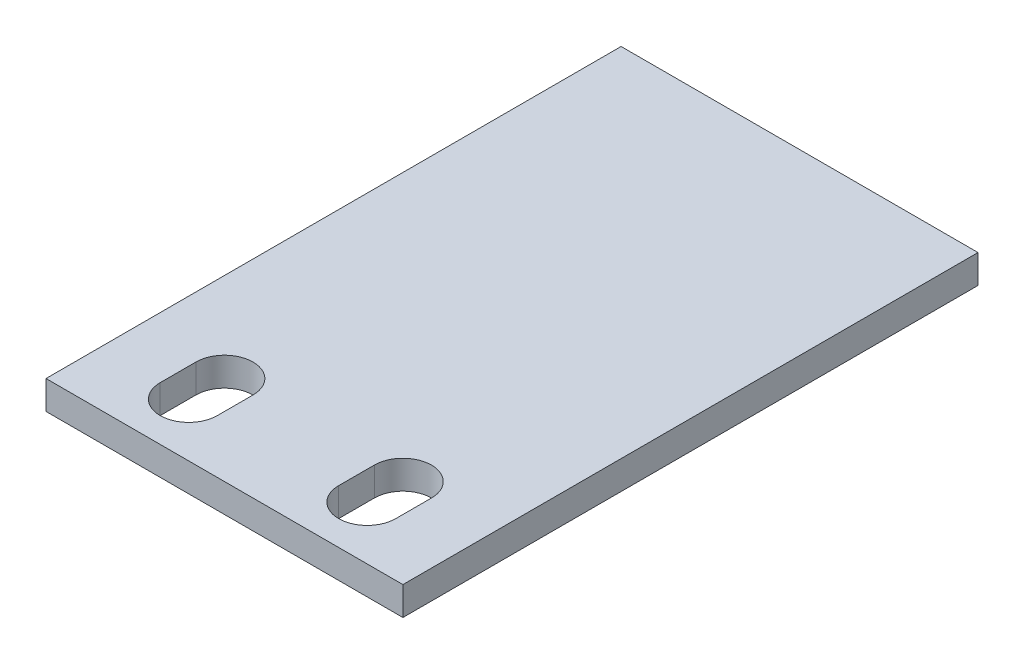
ISO-10303-21;
HEADER;
FILE_DESCRIPTION(('STEP AP214'),'2;1');
FILE_NAME('part.step','',(''),(''),'','','');
FILE_SCHEMA(('AUTOMOTIVE_DESIGN { 1 0 10303 214 1 1 1 1 }'));
ENDSEC;
DATA;
#1=APPLICATION_CONTEXT('core data for automotive mechanical design processes');
#2=APPLICATION_PROTOCOL_DEFINITION('international standard','automotive_design',2000,#1);
#3=PRODUCT_CONTEXT('',#1,'mechanical');
#4=PRODUCT('Part','Part','',(#3));
#5=PRODUCT_RELATED_PRODUCT_CATEGORY('part','',(#4));
#6=PRODUCT_DEFINITION_FORMATION('','',#4);
#7=PRODUCT_DEFINITION_CONTEXT('part definition',#1,'design');
#8=PRODUCT_DEFINITION('design','',#6,#7);
#9=PRODUCT_DEFINITION_SHAPE('','',#8);
#10=(LENGTH_UNIT() NAMED_UNIT(*) SI_UNIT(.MILLI.,.METRE.));
#11=(NAMED_UNIT(*) PLANE_ANGLE_UNIT() SI_UNIT($,.RADIAN.));
#12=(NAMED_UNIT(*) SI_UNIT($,.STERADIAN.) SOLID_ANGLE_UNIT());
#13=UNCERTAINTY_MEASURE_WITH_UNIT(LENGTH_MEASURE(1.E-05),#10,'distance_accuracy_value','');
#14=(GEOMETRIC_REPRESENTATION_CONTEXT(3) GLOBAL_UNCERTAINTY_ASSIGNED_CONTEXT((#13)) GLOBAL_UNIT_ASSIGNED_CONTEXT((#10,
#11,#12)) REPRESENTATION_CONTEXT('',''));
#15=CARTESIAN_POINT('',(0.,0.,0.));
#16=DIRECTION('',(0.,0.,1.));
#17=DIRECTION('',(1.,0.,0.));
#18=AXIS2_PLACEMENT_3D('',#15,#16,#17);
#19=CARTESIAN_POINT('',(10.,1.8,10.0274333882308));
#20=DIRECTION('',(1.,0.,0.));
#21=DIRECTION('',(0.,1.,0.));
#22=AXIS2_PLACEMENT_3D('',#19,#20,#21);
#23=PLANE('',#22);
#24=DIRECTION('',(0.,0.,1.));
#25=VECTOR('',#24,1.);
#26=CARTESIAN_POINT('',(10.,-0.8,9.22743338823082));
#27=LINE('',#26,#25);
#28=CARTESIAN_POINT('',(10.,-0.799999999999996,-10.));
#29=VERTEX_POINT('',#28);
#30=CARTESIAN_POINT('',(10.,-0.8,22.2274333882308));
#31=VERTEX_POINT('',#30);
#32=EDGE_CURVE('E227',#29,#31,#27,.T.);
#33=ORIENTED_EDGE('',*,*,#32,.F.);
#34=DIRECTION('',(0.,-1.,0.));
#35=VECTOR('',#34,1.);
#36=CARTESIAN_POINT('',(10.,0.800000000000004,-10.));
#37=LINE('',#36,#35);
#38=CARTESIAN_POINT('',(10.,0.800000000000004,-10.));
#39=VERTEX_POINT('',#38);
#40=EDGE_CURVE('E160',#39,#29,#37,.T.);
#41=ORIENTED_EDGE('',*,*,#40,.F.);
#42=DIRECTION('',(0.,0.,1.));
#43=VECTOR('',#42,1.);
#44=CARTESIAN_POINT('',(10.,0.8,9.22743338823082));
#45=LINE('',#44,#43);
#46=CARTESIAN_POINT('',(10.,0.8,22.2274333882308));
#47=VERTEX_POINT('',#46);
#48=EDGE_CURVE('E149',#39,#47,#45,.T.);
#49=ORIENTED_EDGE('',*,*,#48,.T.);
#50=DIRECTION('',(0.,1.,0.));
#51=VECTOR('',#50,1.);
#52=CARTESIAN_POINT('',(10.,-0.8,22.2274333882308));
#53=LINE('',#52,#51);
#54=EDGE_CURVE('E223',#31,#47,#53,.T.);
#55=ORIENTED_EDGE('',*,*,#54,.F.);
#56=EDGE_LOOP('',(#33,#41,#49,#55));
#57=FACE_BOUND('',#56,.T.);
#58=ADVANCED_FACE('F45',(#57),#23,.T.);
#59=CARTESIAN_POINT('',(10.,0.8,9.22743338823082));
#60=DIRECTION('',(0.,-1.,0.));
#61=DIRECTION('',(1.,0.,0.));
#62=AXIS2_PLACEMENT_3D('',#59,#60,#61);
#63=PLANE('',#62);
#64=DIRECTION('',(0.,0.,1.));
#65=VECTOR('',#64,1.);
#66=CARTESIAN_POINT('',(6.6,0.8,9.22743338823082));
#67=LINE('',#66,#65);
#68=CARTESIAN_POINT('',(6.6,0.8,17.2274333882308));
#69=VERTEX_POINT('',#68);
#70=CARTESIAN_POINT('',(6.6,0.8,19.2274333882308));
#71=VERTEX_POINT('',#70);
#72=EDGE_CURVE('E217',#69,#71,#67,.T.);
#73=ORIENTED_EDGE('',*,*,#72,.T.);
#74=CARTESIAN_POINT('',(5.,0.8,19.2274333882308));
#75=DIRECTION('',(0.,-1.,0.));
#76=DIRECTION('',(1.,0.,0.));
#77=AXIS2_PLACEMENT_3D('',#74,#75,#76);
#78=CIRCLE('',#77,1.6);
#79=CARTESIAN_POINT('',(3.4,0.8,19.2274333882308));
#80=VERTEX_POINT('',#79);
#81=EDGE_CURVE('E144',#71,#80,#78,.T.);
#82=ORIENTED_EDGE('',*,*,#81,.T.);
#83=DIRECTION('',(0.,0.,-1.));
#84=VECTOR('',#83,1.);
#85=CARTESIAN_POINT('',(3.4,0.8,9.22743338823081));
#86=LINE('',#85,#84);
#87=CARTESIAN_POINT('',(3.4,0.8,17.2274333882308));
#88=VERTEX_POINT('',#87);
#89=EDGE_CURVE('E211',#80,#88,#86,.T.);
#90=ORIENTED_EDGE('',*,*,#89,.T.);
#91=CARTESIAN_POINT('',(5.,0.8,17.2274333882308));
#92=DIRECTION('',(0.,-1.,0.));
#93=DIRECTION('',(1.,0.,0.));
#94=AXIS2_PLACEMENT_3D('',#91,#92,#93);
#95=CIRCLE('',#94,1.6);
#96=EDGE_CURVE('E214',#88,#69,#95,.T.);
#97=ORIENTED_EDGE('',*,*,#96,.T.);
#98=EDGE_LOOP('',(#73,#82,#90,#97));
#99=FACE_BOUND('',#98,.T.);
#100=DIRECTION('',(0.,0.,1.));
#101=VECTOR('',#100,1.);
#102=CARTESIAN_POINT('',(-3.4,0.8,9.22743338823081));
#103=LINE('',#102,#101);
#104=CARTESIAN_POINT('',(-3.4,0.8,17.2274333882308));
#105=VERTEX_POINT('',#104);
#106=CARTESIAN_POINT('',(-3.4,0.8,19.2274333882308));
#107=VERTEX_POINT('',#106);
#108=EDGE_CURVE('E205',#105,#107,#103,.T.);
#109=ORIENTED_EDGE('',*,*,#108,.T.);
#110=CARTESIAN_POINT('',(-5.,0.8,19.2274333882308));
#111=DIRECTION('',(0.,-1.,0.));
#112=DIRECTION('',(1.,0.,0.));
#113=AXIS2_PLACEMENT_3D('',#110,#111,#112);
#114=CIRCLE('',#113,1.6);
#115=CARTESIAN_POINT('',(-6.6,0.8,19.2274333882308));
#116=VERTEX_POINT('',#115);
#117=EDGE_CURVE('E208',#107,#116,#114,.T.);
#118=ORIENTED_EDGE('',*,*,#117,.T.);
#119=DIRECTION('',(0.,0.,-1.));
#120=VECTOR('',#119,1.);
#121=CARTESIAN_POINT('',(-6.6,0.8,9.22743338823082));
#122=LINE('',#121,#120);
#123=CARTESIAN_POINT('',(-6.6,0.8,17.2274333882308));
#124=VERTEX_POINT('',#123);
#125=EDGE_CURVE('E178',#116,#124,#122,.T.);
#126=ORIENTED_EDGE('',*,*,#125,.T.);
#127=CARTESIAN_POINT('',(-5.,0.8,17.2274333882308));
#128=DIRECTION('',(0.,-1.,0.));
#129=DIRECTION('',(1.,0.,0.));
#130=AXIS2_PLACEMENT_3D('',#127,#128,#129);
#131=CIRCLE('',#130,1.6);
#132=EDGE_CURVE('E202',#124,#105,#131,.T.);
#133=ORIENTED_EDGE('',*,*,#132,.T.);
#134=EDGE_LOOP('',(#109,#118,#126,#133));
#135=FACE_BOUND('',#134,.T.);
#136=DIRECTION('',(0.,0.,1.));
#137=VECTOR('',#136,1.);
#138=CARTESIAN_POINT('',(-10.,0.8,9.22743338823082));
#139=LINE('',#138,#137);
#140=CARTESIAN_POINT('',(-10.,0.800000000000004,-10.));
#141=VERTEX_POINT('',#140);
#142=CARTESIAN_POINT('',(-10.,0.8,22.2274333882308));
#143=VERTEX_POINT('',#142);
#144=EDGE_CURVE('E134',#141,#143,#139,.T.);
#145=ORIENTED_EDGE('',*,*,#144,.T.);
#146=DIRECTION('',(-1.,0.,0.));
#147=VECTOR('',#146,1.);
#148=CARTESIAN_POINT('',(10.,0.8,22.2274333882308));
#149=LINE('',#148,#147);
#150=EDGE_CURVE('E12',#47,#143,#149,.T.);
#151=ORIENTED_EDGE('',*,*,#150,.F.);
#152=ORIENTED_EDGE('',*,*,#48,.F.);
#153=DIRECTION('',(-1.,0.,0.));
#154=VECTOR('',#153,1.);
#155=CARTESIAN_POINT('',(10.,0.800000000000004,-10.));
#156=LINE('',#155,#154);
#157=EDGE_CURVE('E147',#39,#141,#156,.T.);
#158=ORIENTED_EDGE('',*,*,#157,.T.);
#159=EDGE_LOOP('',(#145,#151,#152,#158));
#160=FACE_BOUND('',#159,.T.);
#161=ADVANCED_FACE('F148',(#99,#135,#160),#63,.F.);
#162=CARTESIAN_POINT('',(10.,-0.8,22.2274333882308));
#163=DIRECTION('',(0.,0.,1.));
#164=DIRECTION('',(0.,-1.,0.));
#165=AXIS2_PLACEMENT_3D('',#162,#163,#164);
#166=PLANE('',#165);
#167=DIRECTION('',(0.,1.,0.));
#168=VECTOR('',#167,1.);
#169=CARTESIAN_POINT('',(-10.,-0.8,22.2274333882308));
#170=LINE('',#169,#168);
#171=CARTESIAN_POINT('',(-10.,-0.8,22.2274333882308));
#172=VERTEX_POINT('',#171);
#173=EDGE_CURVE('E141',#172,#143,#170,.T.);
#174=ORIENTED_EDGE('',*,*,#173,.F.);
#175=DIRECTION('',(-1.,0.,0.));
#176=VECTOR('',#175,1.);
#177=CARTESIAN_POINT('',(10.,-0.8,22.2274333882308));
#178=LINE('',#177,#176);
#179=EDGE_CURVE('E53',#31,#172,#178,.T.);
#180=ORIENTED_EDGE('',*,*,#179,.F.);
#181=ORIENTED_EDGE('',*,*,#54,.T.);
#182=ORIENTED_EDGE('',*,*,#150,.T.);
#183=EDGE_LOOP('',(#174,#180,#181,#182));
#184=FACE_BOUND('',#183,.T.);
#185=ADVANCED_FACE('F234',(#184),#166,.T.);
#186=CARTESIAN_POINT('',(10.,-0.8,10.));
#187=DIRECTION('',(0.,-1.,0.));
#188=DIRECTION('',(0.,0.,-1.));
#189=AXIS2_PLACEMENT_3D('',#186,#187,#188);
#190=PLANE('',#189);
#191=CARTESIAN_POINT('',(5.,-0.8,19.2274333882308));
#192=DIRECTION('',(0.,-1.,0.));
#193=DIRECTION('',(1.,0.,0.));
#194=AXIS2_PLACEMENT_3D('',#191,#192,#193);
#195=CIRCLE('',#194,1.6);
#196=CARTESIAN_POINT('',(6.6,-0.8,19.2274333882308));
#197=VERTEX_POINT('',#196);
#198=CARTESIAN_POINT('',(3.4,-0.8,19.2274333882308));
#199=VERTEX_POINT('',#198);
#200=EDGE_CURVE('E164',#197,#199,#195,.T.);
#201=ORIENTED_EDGE('',*,*,#200,.F.);
#202=DIRECTION('',(0.,0.,1.));
#203=VECTOR('',#202,1.);
#204=CARTESIAN_POINT('',(6.6,-0.8,19.2274333882308));
#205=LINE('',#204,#203);
#206=CARTESIAN_POINT('',(6.6,-0.8,17.2274333882308));
#207=VERTEX_POINT('',#206);
#208=EDGE_CURVE('E172',#207,#197,#205,.T.);
#209=ORIENTED_EDGE('',*,*,#208,.F.);
#210=CARTESIAN_POINT('',(5.,-0.8,17.2274333882308));
#211=DIRECTION('',(0.,-1.,0.));
#212=DIRECTION('',(1.,0.,0.));
#213=AXIS2_PLACEMENT_3D('',#210,#211,#212);
#214=CIRCLE('',#213,1.6);
#215=CARTESIAN_POINT('',(3.4,-0.8,17.2274333882308));
#216=VERTEX_POINT('',#215);
#217=EDGE_CURVE('E169',#216,#207,#214,.T.);
#218=ORIENTED_EDGE('',*,*,#217,.F.);
#219=DIRECTION('',(0.,0.,-1.));
#220=VECTOR('',#219,1.);
#221=CARTESIAN_POINT('',(3.4,-0.8,19.2274333882308));
#222=LINE('',#221,#220);
#223=EDGE_CURVE('E166',#199,#216,#222,.T.);
#224=ORIENTED_EDGE('',*,*,#223,.F.);
#225=EDGE_LOOP('',(#201,#209,#218,#224));
#226=FACE_BOUND('',#225,.T.);
#227=CARTESIAN_POINT('',(-5.,-0.8,19.2274333882308));
#228=DIRECTION('',(0.,-1.,0.));
#229=DIRECTION('',(1.,0.,0.));
#230=AXIS2_PLACEMENT_3D('',#227,#228,#229);
#231=CIRCLE('',#230,1.6);
#232=CARTESIAN_POINT('',(-3.4,-0.8,19.2274333882308));
#233=VERTEX_POINT('',#232);
#234=CARTESIAN_POINT('',(-6.6,-0.8,19.2274333882308));
#235=VERTEX_POINT('',#234);
#236=EDGE_CURVE('E167',#233,#235,#231,.T.);
#237=ORIENTED_EDGE('',*,*,#236,.F.);
#238=DIRECTION('',(0.,0.,1.));
#239=VECTOR('',#238,1.);
#240=CARTESIAN_POINT('',(-3.4,-0.8,19.2274333882308));
#241=LINE('',#240,#239);
#242=CARTESIAN_POINT('',(-3.4,-0.8,17.2274333882308));
#243=VERTEX_POINT('',#242);
#244=EDGE_CURVE('E187',#243,#233,#241,.T.);
#245=ORIENTED_EDGE('',*,*,#244,.F.);
#246=CARTESIAN_POINT('',(-5.,-0.8,17.2274333882308));
#247=DIRECTION('',(0.,-1.,0.));
#248=DIRECTION('',(1.,0.,0.));
#249=AXIS2_PLACEMENT_3D('',#246,#247,#248);
#250=CIRCLE('',#249,1.6);
#251=CARTESIAN_POINT('',(-6.6,-0.8,17.2274333882308));
#252=VERTEX_POINT('',#251);
#253=EDGE_CURVE('E194',#252,#243,#250,.T.);
#254=ORIENTED_EDGE('',*,*,#253,.F.);
#255=DIRECTION('',(0.,0.,-1.));
#256=VECTOR('',#255,1.);
#257=CARTESIAN_POINT('',(-6.6,-0.8,19.2274333882308));
#258=LINE('',#257,#256);
#259=EDGE_CURVE('E197',#235,#252,#258,.T.);
#260=ORIENTED_EDGE('',*,*,#259,.F.);
#261=EDGE_LOOP('',(#237,#245,#254,#260));
#262=FACE_BOUND('',#261,.T.);
#263=DIRECTION('',(0.,0.,1.));
#264=VECTOR('',#263,1.);
#265=CARTESIAN_POINT('',(-10.,-0.8,9.22743338823082));
#266=LINE('',#265,#264);
#267=CARTESIAN_POINT('',(-10.,-0.799999999999996,-10.));
#268=VERTEX_POINT('',#267);
#269=EDGE_CURVE('E224',#268,#172,#266,.T.);
#270=ORIENTED_EDGE('',*,*,#269,.F.);
#271=DIRECTION('',(-1.,0.,0.));
#272=VECTOR('',#271,1.);
#273=CARTESIAN_POINT('',(10.,-0.799999999999996,-10.));
#274=LINE('',#273,#272);
#275=EDGE_CURVE('E158',#29,#268,#274,.T.);
#276=ORIENTED_EDGE('',*,*,#275,.F.);
#277=ORIENTED_EDGE('',*,*,#32,.T.);
#278=ORIENTED_EDGE('',*,*,#179,.T.);
#279=EDGE_LOOP('',(#270,#276,#277,#278));
#280=FACE_BOUND('',#279,.T.);
#281=ADVANCED_FACE('F47',(#226,#262,#280),#190,.T.);
#282=CARTESIAN_POINT('',(-10.,1.8,11.0274333882308));
#283=DIRECTION('',(1.,0.,0.));
#284=DIRECTION('',(0.,1.,0.));
#285=AXIS2_PLACEMENT_3D('',#282,#283,#284);
#286=PLANE('',#285);
#287=ORIENTED_EDGE('',*,*,#144,.F.);
#288=DIRECTION('',(0.,-1.,0.));
#289=VECTOR('',#288,1.);
#290=CARTESIAN_POINT('',(-10.,0.800000000000004,-10.));
#291=LINE('',#290,#289);
#292=EDGE_CURVE('E139',#141,#268,#291,.T.);
#293=ORIENTED_EDGE('',*,*,#292,.T.);
#294=ORIENTED_EDGE('',*,*,#269,.T.);
#295=ORIENTED_EDGE('',*,*,#173,.T.);
#296=EDGE_LOOP('',(#287,#293,#294,#295));
#297=FACE_BOUND('',#296,.T.);
#298=ADVANCED_FACE('F136',(#297),#286,.F.);
#299=CARTESIAN_POINT('',(-5.,20.,19.2274333882308));
#300=DIRECTION('',(0.,-1.,0.));
#301=DIRECTION('',(1.,0.,0.));
#302=AXIS2_PLACEMENT_3D('',#299,#300,#301);
#303=CYLINDRICAL_SURFACE('',#302,1.6);
#304=DIRECTION('',(0.,-1.,0.));
#305=VECTOR('',#304,1.);
#306=CARTESIAN_POINT('',(-3.4,20.,19.2274333882308));
#307=LINE('',#306,#305);
#308=EDGE_CURVE('E153',#107,#233,#307,.T.);
#309=ORIENTED_EDGE('',*,*,#308,.T.);
#310=ORIENTED_EDGE('',*,*,#236,.T.);
#311=DIRECTION('',(0.,-1.,0.));
#312=VECTOR('',#311,1.);
#313=CARTESIAN_POINT('',(-6.6,20.,19.2274333882308));
#314=LINE('',#313,#312);
#315=EDGE_CURVE('E184',#116,#235,#314,.T.);
#316=ORIENTED_EDGE('',*,*,#315,.F.);
#317=ORIENTED_EDGE('',*,*,#117,.F.);
#318=EDGE_LOOP('',(#309,#310,#316,#317));
#319=FACE_BOUND('',#318,.T.);
#320=ADVANCED_FACE('F247',(#319),#303,.F.);
#321=CARTESIAN_POINT('',(-3.4,20.,19.2274333882308));
#322=DIRECTION('',(1.,0.,0.));
#323=DIRECTION('',(0.,0.,1.));
#324=AXIS2_PLACEMENT_3D('',#321,#322,#323);
#325=PLANE('',#324);
#326=DIRECTION('',(0.,-1.,0.));
#327=VECTOR('',#326,1.);
#328=CARTESIAN_POINT('',(-3.4,20.,17.2274333882308));
#329=LINE('',#328,#327);
#330=EDGE_CURVE('E189',#105,#243,#329,.T.);
#331=ORIENTED_EDGE('',*,*,#330,.T.);
#332=ORIENTED_EDGE('',*,*,#244,.T.);
#333=ORIENTED_EDGE('',*,*,#308,.F.);
#334=ORIENTED_EDGE('',*,*,#108,.F.);
#335=EDGE_LOOP('',(#331,#332,#333,#334));
#336=FACE_BOUND('',#335,.T.);
#337=ADVANCED_FACE('F248',(#336),#325,.F.);
#338=CARTESIAN_POINT('',(-5.,20.,17.2274333882308));
#339=DIRECTION('',(0.,-1.,0.));
#340=DIRECTION('',(1.,0.,0.));
#341=AXIS2_PLACEMENT_3D('',#338,#339,#340);
#342=CYLINDRICAL_SURFACE('',#341,1.6);
#343=DIRECTION('',(0.,-1.,0.));
#344=VECTOR('',#343,1.);
#345=CARTESIAN_POINT('',(-6.6,20.,17.2274333882308));
#346=LINE('',#345,#344);
#347=EDGE_CURVE('E68',#124,#252,#346,.T.);
#348=ORIENTED_EDGE('',*,*,#347,.T.);
#349=ORIENTED_EDGE('',*,*,#253,.T.);
#350=ORIENTED_EDGE('',*,*,#330,.F.);
#351=ORIENTED_EDGE('',*,*,#132,.F.);
#352=EDGE_LOOP('',(#348,#349,#350,#351));
#353=FACE_BOUND('',#352,.T.);
#354=ADVANCED_FACE('F251',(#353),#342,.F.);
#355=CARTESIAN_POINT('',(-6.6,20.,19.2274333882308));
#356=DIRECTION('',(-1.,0.,0.));
#357=DIRECTION('',(0.,-1.,0.));
#358=AXIS2_PLACEMENT_3D('',#355,#356,#357);
#359=PLANE('',#358);
#360=ORIENTED_EDGE('',*,*,#315,.T.);
#361=ORIENTED_EDGE('',*,*,#259,.T.);
#362=ORIENTED_EDGE('',*,*,#347,.F.);
#363=ORIENTED_EDGE('',*,*,#125,.F.);
#364=EDGE_LOOP('',(#360,#361,#362,#363));
#365=FACE_BOUND('',#364,.T.);
#366=ADVANCED_FACE('F255',(#365),#359,.F.);
#367=CARTESIAN_POINT('',(5.,20.,19.2274333882308));
#368=DIRECTION('',(0.,-1.,0.));
#369=DIRECTION('',(1.,0.,0.));
#370=AXIS2_PLACEMENT_3D('',#367,#368,#369);
#371=CYLINDRICAL_SURFACE('',#370,1.6);
#372=DIRECTION('',(0.,-1.,0.));
#373=VECTOR('',#372,1.);
#374=CARTESIAN_POINT('',(6.6,20.,19.2274333882308));
#375=LINE('',#374,#373);
#376=EDGE_CURVE('E176',#71,#197,#375,.T.);
#377=ORIENTED_EDGE('',*,*,#376,.T.);
#378=ORIENTED_EDGE('',*,*,#200,.T.);
#379=DIRECTION('',(0.,-1.,0.));
#380=VECTOR('',#379,1.);
#381=CARTESIAN_POINT('',(3.4,20.,19.2274333882308));
#382=LINE('',#381,#380);
#383=EDGE_CURVE('E175',#80,#199,#382,.T.);
#384=ORIENTED_EDGE('',*,*,#383,.F.);
#385=ORIENTED_EDGE('',*,*,#81,.F.);
#386=EDGE_LOOP('',(#377,#378,#384,#385));
#387=FACE_BOUND('',#386,.T.);
#388=ADVANCED_FACE('F259',(#387),#371,.F.);
#389=CARTESIAN_POINT('',(6.6,20.,19.2274333882308));
#390=DIRECTION('',(1.,0.,0.));
#391=DIRECTION('',(0.,1.,0.));
#392=AXIS2_PLACEMENT_3D('',#389,#390,#391);
#393=PLANE('',#392);
#394=DIRECTION('',(0.,-1.,0.));
#395=VECTOR('',#394,1.);
#396=CARTESIAN_POINT('',(6.6,20.,17.2274333882308));
#397=LINE('',#396,#395);
#398=EDGE_CURVE('E179',#69,#207,#397,.T.);
#399=ORIENTED_EDGE('',*,*,#398,.T.);
#400=ORIENTED_EDGE('',*,*,#208,.T.);
#401=ORIENTED_EDGE('',*,*,#376,.F.);
#402=ORIENTED_EDGE('',*,*,#72,.F.);
#403=EDGE_LOOP('',(#399,#400,#401,#402));
#404=FACE_BOUND('',#403,.T.);
#405=ADVANCED_FACE('F265',(#404),#393,.F.);
#406=CARTESIAN_POINT('',(5.,20.,17.2274333882308));
#407=DIRECTION('',(0.,-1.,0.));
#408=DIRECTION('',(1.,0.,0.));
#409=AXIS2_PLACEMENT_3D('',#406,#407,#408);
#410=CYLINDRICAL_SURFACE('',#409,1.6);
#411=DIRECTION('',(0.,-1.,0.));
#412=VECTOR('',#411,1.);
#413=CARTESIAN_POINT('',(3.4,20.,17.2274333882308));
#414=LINE('',#413,#412);
#415=EDGE_CURVE('E60',#88,#216,#414,.T.);
#416=ORIENTED_EDGE('',*,*,#415,.T.);
#417=ORIENTED_EDGE('',*,*,#217,.T.);
#418=ORIENTED_EDGE('',*,*,#398,.F.);
#419=ORIENTED_EDGE('',*,*,#96,.F.);
#420=EDGE_LOOP('',(#416,#417,#418,#419));
#421=FACE_BOUND('',#420,.T.);
#422=ADVANCED_FACE('F270',(#421),#410,.F.);
#423=CARTESIAN_POINT('',(3.4,20.,19.2274333882308));
#424=DIRECTION('',(-1.,0.,0.));
#425=DIRECTION('',(0.,0.,-1.));
#426=AXIS2_PLACEMENT_3D('',#423,#424,#425);
#427=PLANE('',#426);
#428=ORIENTED_EDGE('',*,*,#383,.T.);
#429=ORIENTED_EDGE('',*,*,#223,.T.);
#430=ORIENTED_EDGE('',*,*,#415,.F.);
#431=ORIENTED_EDGE('',*,*,#89,.F.);
#432=EDGE_LOOP('',(#428,#429,#430,#431));
#433=FACE_BOUND('',#432,.T.);
#434=ADVANCED_FACE('F267',(#433),#427,.F.);
#435=CARTESIAN_POINT('',(10.,0.800000000000004,-10.));
#436=DIRECTION('',(0.,0.,-1.));
#437=DIRECTION('',(-1.,0.,0.));
#438=AXIS2_PLACEMENT_3D('',#435,#436,#437);
#439=PLANE('',#438);
#440=ORIENTED_EDGE('',*,*,#292,.F.);
#441=ORIENTED_EDGE('',*,*,#157,.F.);
#442=ORIENTED_EDGE('',*,*,#40,.T.);
#443=ORIENTED_EDGE('',*,*,#275,.T.);
#444=EDGE_LOOP('',(#440,#441,#442,#443));
#445=FACE_BOUND('',#444,.T.);
#446=ADVANCED_FACE('F156',(#445),#439,.T.);
#447=CLOSED_SHELL('',(#58,#161,#185,#281,#298,#320,#337,#354,#366,#388,#405,#422,#434,#446));
#448=MANIFOLD_SOLID_BREP('B2',#447);
#449=ADVANCED_BREP_SHAPE_REPRESENTATION('',(#18,#448),#14);
#450=SHAPE_DEFINITION_REPRESENTATION(#9,#449);
ENDSEC;
END-ISO-10303-21;
